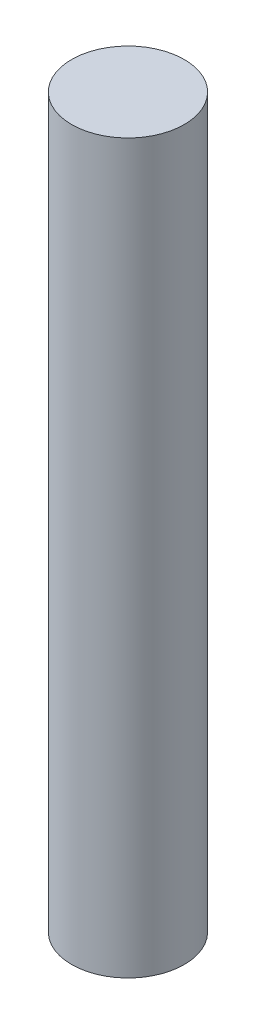
ISO-10303-21;
HEADER;
FILE_DESCRIPTION(('STEP AP214'),'2;1');
FILE_NAME('part.step','',(''),(''),'','','');
FILE_SCHEMA(('AUTOMOTIVE_DESIGN { 1 0 10303 214 1 1 1 1 }'));
ENDSEC;
DATA;
#1=APPLICATION_CONTEXT('core data for automotive mechanical design processes');
#2=APPLICATION_PROTOCOL_DEFINITION('international standard','automotive_design',2000,#1);
#3=PRODUCT_CONTEXT('',#1,'mechanical');
#4=PRODUCT('Part','Part','',(#3));
#5=PRODUCT_RELATED_PRODUCT_CATEGORY('part','',(#4));
#6=PRODUCT_DEFINITION_FORMATION('','',#4);
#7=PRODUCT_DEFINITION_CONTEXT('part definition',#1,'design');
#8=PRODUCT_DEFINITION('design','',#6,#7);
#9=PRODUCT_DEFINITION_SHAPE('','',#8);
#10=(LENGTH_UNIT() NAMED_UNIT(*) SI_UNIT(.MILLI.,.METRE.));
#11=(NAMED_UNIT(*) PLANE_ANGLE_UNIT() SI_UNIT($,.RADIAN.));
#12=(NAMED_UNIT(*) SI_UNIT($,.STERADIAN.) SOLID_ANGLE_UNIT());
#13=UNCERTAINTY_MEASURE_WITH_UNIT(LENGTH_MEASURE(1.E-05),#10,'distance_accuracy_value','');
#14=(GEOMETRIC_REPRESENTATION_CONTEXT(3) GLOBAL_UNCERTAINTY_ASSIGNED_CONTEXT((#13)) GLOBAL_UNIT_ASSIGNED_CONTEXT((#10,
#11,#12)) REPRESENTATION_CONTEXT('',''));
#15=CARTESIAN_POINT('',(0.,0.,0.));
#16=DIRECTION('',(0.,0.,1.));
#17=DIRECTION('',(1.,0.,0.));
#18=AXIS2_PLACEMENT_3D('',#15,#16,#17);
#19=CARTESIAN_POINT('',(-17.2623410942379,51.,-6.38949437279734));
#20=DIRECTION('',(0.,-1.,0.));
#21=DIRECTION('',(0.,0.,-1.));
#22=AXIS2_PLACEMENT_3D('',#19,#20,#21);
#23=CYLINDRICAL_SURFACE('',#22,3.94999999999999);
#24=CARTESIAN_POINT('',(-17.2623410942379,51.,-6.38949437279734));
#25=DIRECTION('',(0.,1.,0.));
#26=DIRECTION('',(0.,0.,1.));
#27=AXIS2_PLACEMENT_3D('',#24,#25,#26);
#28=CIRCLE('',#27,3.94999999999999);
#29=CARTESIAN_POINT('',(-17.2623410942379,51.,-2.43949437279735));
#30=VERTEX_POINT('',#29);
#31=EDGE_CURVE('E10',#30,#30,#28,.T.);
#32=ORIENTED_EDGE('',*,*,#31,.F.);
#33=EDGE_LOOP('',(#32));
#34=FACE_BOUND('',#33,.T.);
#35=CARTESIAN_POINT('',(-17.2623410942379,0.,-6.38949437279734));
#36=DIRECTION('',(0.,1.,0.));
#37=DIRECTION('',(0.,0.,1.));
#38=AXIS2_PLACEMENT_3D('',#35,#36,#37);
#39=CIRCLE('',#38,3.94999999999999);
#40=CARTESIAN_POINT('',(-17.2623410942379,0.,-2.43949437279735));
#41=VERTEX_POINT('',#40);
#42=EDGE_CURVE('E34',#41,#41,#39,.T.);
#43=ORIENTED_EDGE('',*,*,#42,.T.);
#44=EDGE_LOOP('',(#43));
#45=FACE_BOUND('',#44,.T.);
#46=ADVANCED_FACE('F31',(#34,#45),#23,.T.);
#47=CARTESIAN_POINT('',(-17.2623410942379,51.,-6.38949437279734));
#48=DIRECTION('',(0.,1.,0.));
#49=DIRECTION('',(0.,0.,1.));
#50=AXIS2_PLACEMENT_3D('',#47,#48,#49);
#51=PLANE('',#50);
#52=ORIENTED_EDGE('',*,*,#31,.T.);
#53=EDGE_LOOP('',(#52));
#54=FACE_BOUND('',#53,.T.);
#55=ADVANCED_FACE('F46',(#54),#51,.T.);
#56=CARTESIAN_POINT('',(-17.2623410942379,0.,-6.38949437279734));
#57=DIRECTION('',(0.,1.,0.));
#58=DIRECTION('',(0.,0.,1.));
#59=AXIS2_PLACEMENT_3D('',#56,#57,#58);
#60=PLANE('',#59);
#61=ORIENTED_EDGE('',*,*,#42,.F.);
#62=EDGE_LOOP('',(#61));
#63=FACE_BOUND('',#62,.T.);
#64=ADVANCED_FACE('F44',(#63),#60,.F.);
#65=CLOSED_SHELL('',(#46,#55,#64));
#66=MANIFOLD_SOLID_BREP('B2',#65);
#67=ADVANCED_BREP_SHAPE_REPRESENTATION('',(#18,#66),#14);
#68=SHAPE_DEFINITION_REPRESENTATION(#9,#67);
ENDSEC;
END-ISO-10303-21;
